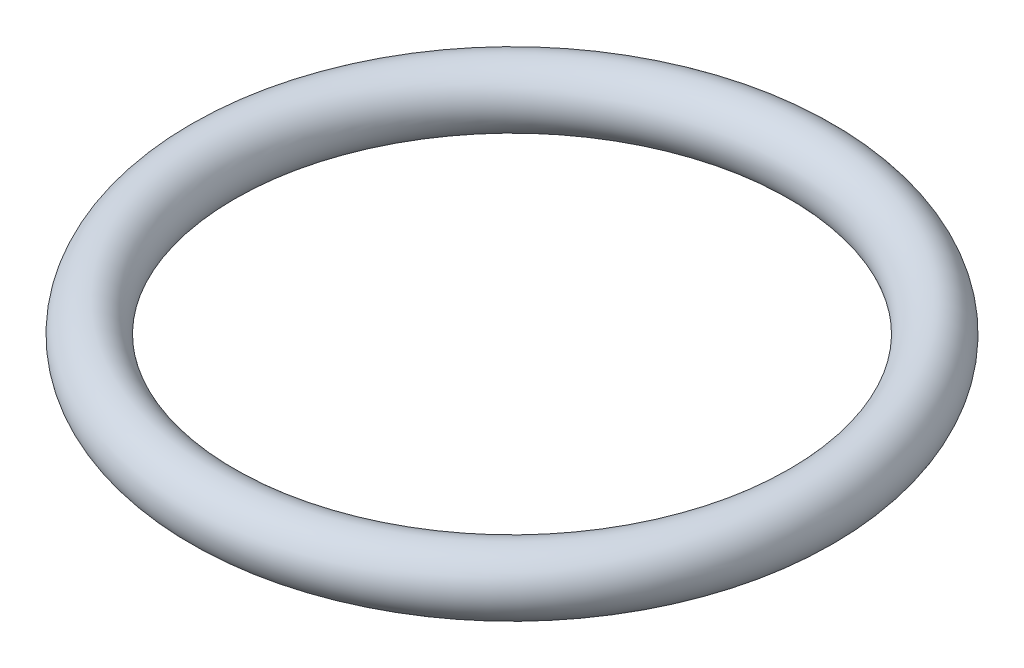
ISO-10303-21;
HEADER;
FILE_DESCRIPTION(('STEP AP214'),'2;1');
FILE_NAME('part.step','',(''),(''),'','','');
FILE_SCHEMA(('AUTOMOTIVE_DESIGN { 1 0 10303 214 1 1 1 1 }'));
ENDSEC;
DATA;
#1=APPLICATION_CONTEXT('core data for automotive mechanical design processes');
#2=APPLICATION_PROTOCOL_DEFINITION('international standard','automotive_design',2000,#1);
#3=PRODUCT_CONTEXT('',#1,'mechanical');
#4=PRODUCT('Part','Part','',(#3));
#5=PRODUCT_RELATED_PRODUCT_CATEGORY('part','',(#4));
#6=PRODUCT_DEFINITION_FORMATION('','',#4);
#7=PRODUCT_DEFINITION_CONTEXT('part definition',#1,'design');
#8=PRODUCT_DEFINITION('design','',#6,#7);
#9=PRODUCT_DEFINITION_SHAPE('','',#8);
#10=(LENGTH_UNIT() NAMED_UNIT(*) SI_UNIT(.MILLI.,.METRE.));
#11=(NAMED_UNIT(*) PLANE_ANGLE_UNIT() SI_UNIT($,.RADIAN.));
#12=(NAMED_UNIT(*) SI_UNIT($,.STERADIAN.) SOLID_ANGLE_UNIT());
#13=UNCERTAINTY_MEASURE_WITH_UNIT(LENGTH_MEASURE(1.E-05),#10,'distance_accuracy_value','');
#14=(GEOMETRIC_REPRESENTATION_CONTEXT(3) GLOBAL_UNCERTAINTY_ASSIGNED_CONTEXT((#13)) GLOBAL_UNIT_ASSIGNED_CONTEXT((#10,
#11,#12)) REPRESENTATION_CONTEXT('',''));
#15=CARTESIAN_POINT('',(0.,0.,0.));
#16=DIRECTION('',(0.,0.,1.));
#17=DIRECTION('',(1.,0.,0.));
#18=AXIS2_PLACEMENT_3D('',#15,#16,#17);
#19=CARTESIAN_POINT('',(0.,0.,0.));
#20=DIRECTION('',(0.,1.,0.));
#21=DIRECTION('',(1.,0.,0.));
#22=AXIS2_PLACEMENT_3D('',#19,#20,#21);
#23=TOROIDAL_SURFACE('',#22,17.1,1.75);
#24=ADVANCED_FACE('F13',(),#23,.T.);
#25=CLOSED_SHELL('',(#24));
#26=MANIFOLD_SOLID_BREP('B1',#25);
#27=ADVANCED_BREP_SHAPE_REPRESENTATION('',(#18,#26),#14);
#28=SHAPE_DEFINITION_REPRESENTATION(#9,#27);
ENDSEC;
END-ISO-10303-21;
